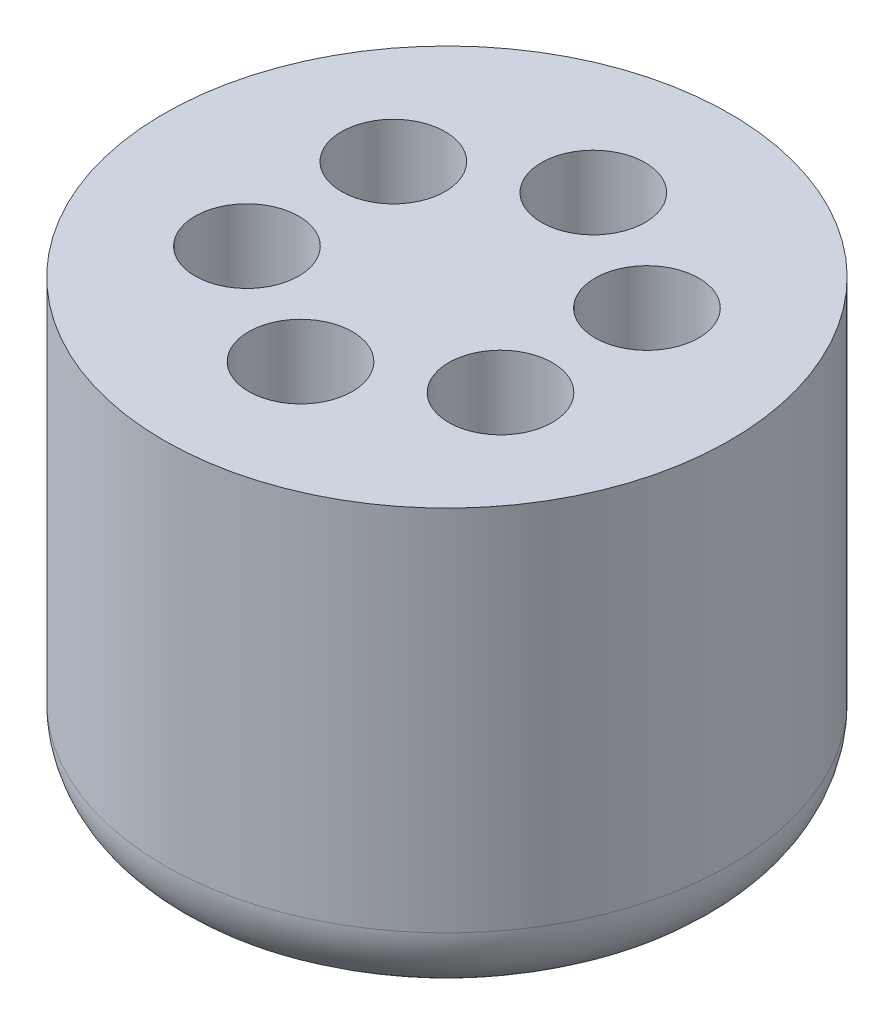
ISO-10303-21;
HEADER;
FILE_DESCRIPTION(('STEP AP214'),'2;1');
FILE_NAME('part.step','',(''),(''),'','','');
FILE_SCHEMA(('AUTOMOTIVE_DESIGN { 1 0 10303 214 1 1 1 1 }'));
ENDSEC;
DATA;
#1=APPLICATION_CONTEXT('core data for automotive mechanical design processes');
#2=APPLICATION_PROTOCOL_DEFINITION('international standard','automotive_design',2000,#1);
#3=PRODUCT_CONTEXT('',#1,'mechanical');
#4=PRODUCT('Part','Part','',(#3));
#5=PRODUCT_RELATED_PRODUCT_CATEGORY('part','',(#4));
#6=PRODUCT_DEFINITION_FORMATION('','',#4);
#7=PRODUCT_DEFINITION_CONTEXT('part definition',#1,'design');
#8=PRODUCT_DEFINITION('design','',#6,#7);
#9=PRODUCT_DEFINITION_SHAPE('','',#8);
#10=(LENGTH_UNIT() NAMED_UNIT(*) SI_UNIT(.MILLI.,.METRE.));
#11=(NAMED_UNIT(*) PLANE_ANGLE_UNIT() SI_UNIT($,.RADIAN.));
#12=(NAMED_UNIT(*) SI_UNIT($,.STERADIAN.) SOLID_ANGLE_UNIT());
#13=UNCERTAINTY_MEASURE_WITH_UNIT(LENGTH_MEASURE(1.E-05),#10,'distance_accuracy_value','');
#14=(GEOMETRIC_REPRESENTATION_CONTEXT(3) GLOBAL_UNCERTAINTY_ASSIGNED_CONTEXT((#13)) GLOBAL_UNIT_ASSIGNED_CONTEXT((#10,
#11,#12)) REPRESENTATION_CONTEXT('',''));
#15=CARTESIAN_POINT('',(0.,0.,0.));
#16=DIRECTION('',(0.,0.,1.));
#17=DIRECTION('',(1.,0.,0.));
#18=AXIS2_PLACEMENT_3D('',#15,#16,#17);
#19=CARTESIAN_POINT('',(0.,47.,0.));
#20=DIRECTION('',(0.,-1.,0.));
#21=DIRECTION('',(0.,0.,-1.));
#22=AXIS2_PLACEMENT_3D('',#19,#20,#21);
#23=CYLINDRICAL_SURFACE('',#22,30.);
#24=CARTESIAN_POINT('',(0.,8.,0.));
#25=DIRECTION('',(0.,1.,0.));
#26=DIRECTION('',(0.,0.,1.));
#27=AXIS2_PLACEMENT_3D('',#24,#25,#26);
#28=CIRCLE('',#27,30.);
#29=CARTESIAN_POINT('',(0.,8.,30.));
#30=VERTEX_POINT('',#29);
#31=EDGE_CURVE('E51',#30,#30,#28,.T.);
#32=ORIENTED_EDGE('',*,*,#31,.T.);
#33=EDGE_LOOP('',(#32));
#34=FACE_BOUND('',#33,.T.);
#35=CARTESIAN_POINT('',(0.,47.,0.));
#36=DIRECTION('',(0.,1.,0.));
#37=DIRECTION('',(0.,0.,1.));
#38=AXIS2_PLACEMENT_3D('',#35,#36,#37);
#39=CIRCLE('',#38,30.);
#40=CARTESIAN_POINT('',(0.,47.,30.));
#41=VERTEX_POINT('',#40);
#42=EDGE_CURVE('E56',#41,#41,#39,.T.);
#43=ORIENTED_EDGE('',*,*,#42,.F.);
#44=EDGE_LOOP('',(#43));
#45=FACE_BOUND('',#44,.T.);
#46=ADVANCED_FACE('F43',(#34,#45),#23,.T.);
#47=CARTESIAN_POINT('',(0.,47.,0.));
#48=DIRECTION('',(0.,1.,0.));
#49=DIRECTION('',(0.,0.,1.));
#50=AXIS2_PLACEMENT_3D('',#47,#48,#49);
#51=PLANE('',#50);
#52=CARTESIAN_POINT('',(-13.4407142667345,47.,-7.76000000000003));
#53=DIRECTION('',(0.,1.,0.));
#54=DIRECTION('',(0.,0.,1.));
#55=AXIS2_PLACEMENT_3D('',#52,#53,#54);
#56=CIRCLE('',#55,5.5);
#57=CARTESIAN_POINT('',(-13.4407142667345,47.,-2.26000000000003));
#58=VERTEX_POINT('',#57);
#59=EDGE_CURVE('E67',#58,#58,#56,.T.);
#60=ORIENTED_EDGE('',*,*,#59,.F.);
#61=EDGE_LOOP('',(#60));
#62=FACE_BOUND('',#61,.T.);
#63=CARTESIAN_POINT('',(-13.4407142667345,47.,7.76000000000006));
#64=DIRECTION('',(0.,1.,0.));
#65=DIRECTION('',(0.,0.,1.));
#66=AXIS2_PLACEMENT_3D('',#63,#64,#65);
#67=CIRCLE('',#66,5.5);
#68=CARTESIAN_POINT('',(-13.4407142667345,47.,13.2600000000001));
#69=VERTEX_POINT('',#68);
#70=EDGE_CURVE('E77',#69,#69,#67,.T.);
#71=ORIENTED_EDGE('',*,*,#70,.F.);
#72=EDGE_LOOP('',(#71));
#73=FACE_BOUND('',#72,.T.);
#74=CARTESIAN_POINT('',(0.,47.,15.52));
#75=DIRECTION('',(0.,1.,0.));
#76=DIRECTION('',(0.,0.,1.));
#77=AXIS2_PLACEMENT_3D('',#74,#75,#76);
#78=CIRCLE('',#77,5.5);
#79=CARTESIAN_POINT('',(0.,47.,21.02));
#80=VERTEX_POINT('',#79);
#81=EDGE_CURVE('E72',#80,#80,#78,.T.);
#82=ORIENTED_EDGE('',*,*,#81,.F.);
#83=EDGE_LOOP('',(#82));
#84=FACE_BOUND('',#83,.T.);
#85=CARTESIAN_POINT('',(13.4407142667345,47.,7.76000000000002));
#86=DIRECTION('',(0.,1.,0.));
#87=DIRECTION('',(0.,0.,1.));
#88=AXIS2_PLACEMENT_3D('',#85,#86,#87);
#89=CIRCLE('',#88,5.5);
#90=CARTESIAN_POINT('',(13.4407142667345,47.,13.26));
#91=VERTEX_POINT('',#90);
#92=EDGE_CURVE('E68',#91,#91,#89,.T.);
#93=ORIENTED_EDGE('',*,*,#92,.F.);
#94=EDGE_LOOP('',(#93));
#95=FACE_BOUND('',#94,.T.);
#96=CARTESIAN_POINT('',(13.4407142667345,47.,-7.76));
#97=DIRECTION('',(0.,1.,0.));
#98=DIRECTION('',(0.,0.,1.));
#99=AXIS2_PLACEMENT_3D('',#96,#97,#98);
#100=CIRCLE('',#99,5.5);
#101=CARTESIAN_POINT('',(13.4407142667345,47.,-2.26));
#102=VERTEX_POINT('',#101);
#103=EDGE_CURVE('E73',#102,#102,#100,.T.);
#104=ORIENTED_EDGE('',*,*,#103,.F.);
#105=EDGE_LOOP('',(#104));
#106=FACE_BOUND('',#105,.T.);
#107=CARTESIAN_POINT('',(0.,47.,-15.52));
#108=DIRECTION('',(0.,1.,0.));
#109=DIRECTION('',(0.,0.,1.));
#110=AXIS2_PLACEMENT_3D('',#107,#108,#109);
#111=CIRCLE('',#110,5.5);
#112=CARTESIAN_POINT('',(0.,47.,-10.02));
#113=VERTEX_POINT('',#112);
#114=EDGE_CURVE('E61',#113,#113,#111,.T.);
#115=ORIENTED_EDGE('',*,*,#114,.F.);
#116=EDGE_LOOP('',(#115));
#117=FACE_BOUND('',#116,.T.);
#118=ORIENTED_EDGE('',*,*,#42,.T.);
#119=EDGE_LOOP('',(#118));
#120=FACE_BOUND('',#119,.T.);
#121=ADVANCED_FACE('F133',(#62,#73,#84,#95,#106,#117,#120),#51,.T.);
#122=CARTESIAN_POINT('',(0.,0.,0.));
#123=DIRECTION('',(0.,1.,0.));
#124=DIRECTION('',(0.,0.,1.));
#125=AXIS2_PLACEMENT_3D('',#122,#123,#124);
#126=PLANE('',#125);
#127=CARTESIAN_POINT('',(0.,0.,0.));
#128=DIRECTION('',(0.,1.,0.));
#129=DIRECTION('',(0.,0.,1.));
#130=AXIS2_PLACEMENT_3D('',#127,#128,#129);
#131=CIRCLE('',#130,22.);
#132=CARTESIAN_POINT('',(0.,0.,22.));
#133=VERTEX_POINT('',#132);
#134=EDGE_CURVE('E10',#133,#133,#131,.F.);
#135=ORIENTED_EDGE('',*,*,#134,.T.);
#136=EDGE_LOOP('',(#135));
#137=FACE_BOUND('',#136,.T.);
#138=ADVANCED_FACE('F127',(#137),#126,.F.);
#139=CARTESIAN_POINT('',(0.,15.,-15.52));
#140=DIRECTION('',(0.,1.,0.));
#141=DIRECTION('',(0.,0.,1.));
#142=AXIS2_PLACEMENT_3D('',#139,#140,#141);
#143=CYLINDRICAL_SURFACE('',#142,5.5);
#144=ORIENTED_EDGE('',*,*,#114,.T.);
#145=EDGE_LOOP('',(#144));
#146=FACE_BOUND('',#145,.T.);
#147=CARTESIAN_POINT('',(0.,12.,-15.52));
#148=DIRECTION('',(0.,1.,0.));
#149=DIRECTION('',(0.,0.,1.));
#150=AXIS2_PLACEMENT_3D('',#147,#148,#149);
#151=CIRCLE('',#150,5.5);
#152=CARTESIAN_POINT('',(0.,12.,-10.02));
#153=VERTEX_POINT('',#152);
#154=EDGE_CURVE('E87',#153,#153,#151,.T.);
#155=ORIENTED_EDGE('',*,*,#154,.F.);
#156=EDGE_LOOP('',(#155));
#157=FACE_BOUND('',#156,.T.);
#158=ADVANCED_FACE('F117',(#146,#157),#143,.F.);
#159=CARTESIAN_POINT('',(13.4407142667345,15.,-7.76));
#160=DIRECTION('',(0.,1.,0.));
#161=DIRECTION('',(0.,0.,1.));
#162=AXIS2_PLACEMENT_3D('',#159,#160,#161);
#163=CYLINDRICAL_SURFACE('',#162,5.5);
#164=ORIENTED_EDGE('',*,*,#103,.T.);
#165=EDGE_LOOP('',(#164));
#166=FACE_BOUND('',#165,.T.);
#167=CARTESIAN_POINT('',(13.4407142667345,12.,-7.76));
#168=DIRECTION('',(0.,1.,0.));
#169=DIRECTION('',(0.,0.,1.));
#170=AXIS2_PLACEMENT_3D('',#167,#168,#169);
#171=CIRCLE('',#170,5.5);
#172=CARTESIAN_POINT('',(13.4407142667345,12.,-2.26));
#173=VERTEX_POINT('',#172);
#174=EDGE_CURVE('E97',#173,#173,#171,.T.);
#175=ORIENTED_EDGE('',*,*,#174,.F.);
#176=EDGE_LOOP('',(#175));
#177=FACE_BOUND('',#176,.T.);
#178=ADVANCED_FACE('F114',(#166,#177),#163,.F.);
#179=CARTESIAN_POINT('',(13.4407142667345,15.,7.76000000000002));
#180=DIRECTION('',(0.,1.,0.));
#181=DIRECTION('',(0.,0.,1.));
#182=AXIS2_PLACEMENT_3D('',#179,#180,#181);
#183=CYLINDRICAL_SURFACE('',#182,5.5);
#184=ORIENTED_EDGE('',*,*,#92,.T.);
#185=EDGE_LOOP('',(#184));
#186=FACE_BOUND('',#185,.T.);
#187=CARTESIAN_POINT('',(13.4407142667345,12.,7.76000000000002));
#188=DIRECTION('',(0.,1.,0.));
#189=DIRECTION('',(0.,0.,1.));
#190=AXIS2_PLACEMENT_3D('',#187,#188,#189);
#191=CIRCLE('',#190,5.5);
#192=CARTESIAN_POINT('',(13.4407142667345,12.,13.26));
#193=VERTEX_POINT('',#192);
#194=EDGE_CURVE('E92',#193,#193,#191,.T.);
#195=ORIENTED_EDGE('',*,*,#194,.F.);
#196=EDGE_LOOP('',(#195));
#197=FACE_BOUND('',#196,.T.);
#198=ADVANCED_FACE('F116',(#186,#197),#183,.F.);
#199=CARTESIAN_POINT('',(0.,15.,15.52));
#200=DIRECTION('',(0.,1.,0.));
#201=DIRECTION('',(0.,0.,1.));
#202=AXIS2_PLACEMENT_3D('',#199,#200,#201);
#203=CYLINDRICAL_SURFACE('',#202,5.5);
#204=ORIENTED_EDGE('',*,*,#81,.T.);
#205=EDGE_LOOP('',(#204));
#206=FACE_BOUND('',#205,.T.);
#207=CARTESIAN_POINT('',(0.,12.,15.52));
#208=DIRECTION('',(0.,1.,0.));
#209=DIRECTION('',(0.,0.,1.));
#210=AXIS2_PLACEMENT_3D('',#207,#208,#209);
#211=CIRCLE('',#210,5.5);
#212=CARTESIAN_POINT('',(0.,12.,21.02));
#213=VERTEX_POINT('',#212);
#214=EDGE_CURVE('E96',#213,#213,#211,.T.);
#215=ORIENTED_EDGE('',*,*,#214,.F.);
#216=EDGE_LOOP('',(#215));
#217=FACE_BOUND('',#216,.T.);
#218=ADVANCED_FACE('F124',(#206,#217),#203,.F.);
#219=CARTESIAN_POINT('',(-13.4407142667345,15.,7.76000000000006));
#220=DIRECTION('',(0.,1.,0.));
#221=DIRECTION('',(0.,0.,1.));
#222=AXIS2_PLACEMENT_3D('',#219,#220,#221);
#223=CYLINDRICAL_SURFACE('',#222,5.5);
#224=ORIENTED_EDGE('',*,*,#70,.T.);
#225=EDGE_LOOP('',(#224));
#226=FACE_BOUND('',#225,.T.);
#227=CARTESIAN_POINT('',(-13.4407142667345,12.,7.76000000000006));
#228=DIRECTION('',(0.,1.,0.));
#229=DIRECTION('',(0.,0.,1.));
#230=AXIS2_PLACEMENT_3D('',#227,#228,#229);
#231=CIRCLE('',#230,5.5);
#232=CARTESIAN_POINT('',(-13.4407142667345,12.,13.2600000000001));
#233=VERTEX_POINT('',#232);
#234=EDGE_CURVE('E101',#233,#233,#231,.T.);
#235=ORIENTED_EDGE('',*,*,#234,.F.);
#236=EDGE_LOOP('',(#235));
#237=FACE_BOUND('',#236,.T.);
#238=ADVANCED_FACE('F145',(#226,#237),#223,.F.);
#239=CARTESIAN_POINT('',(-13.4407142667345,15.,-7.76000000000003));
#240=DIRECTION('',(0.,1.,0.));
#241=DIRECTION('',(0.,0.,1.));
#242=AXIS2_PLACEMENT_3D('',#239,#240,#241);
#243=CYLINDRICAL_SURFACE('',#242,5.5);
#244=ORIENTED_EDGE('',*,*,#59,.T.);
#245=EDGE_LOOP('',(#244));
#246=FACE_BOUND('',#245,.T.);
#247=CARTESIAN_POINT('',(-13.4407142667345,12.,-7.76000000000003));
#248=DIRECTION('',(0.,1.,0.));
#249=DIRECTION('',(0.,0.,1.));
#250=AXIS2_PLACEMENT_3D('',#247,#248,#249);
#251=CIRCLE('',#250,5.5);
#252=CARTESIAN_POINT('',(-13.4407142667345,12.,-2.26000000000003));
#253=VERTEX_POINT('',#252);
#254=EDGE_CURVE('E91',#253,#253,#251,.T.);
#255=ORIENTED_EDGE('',*,*,#254,.F.);
#256=EDGE_LOOP('',(#255));
#257=FACE_BOUND('',#256,.T.);
#258=ADVANCED_FACE('F148',(#246,#257),#243,.F.);
#259=CARTESIAN_POINT('',(0.,8.,0.));
#260=DIRECTION('',(0.,1.,0.));
#261=DIRECTION('',(0.,0.,1.));
#262=AXIS2_PLACEMENT_3D('',#259,#260,#261);
#263=TOROIDAL_SURFACE('',#262,22.,8.);
#264=ORIENTED_EDGE('',*,*,#134,.F.);
#265=EDGE_LOOP('',(#264));
#266=FACE_BOUND('',#265,.T.);
#267=ORIENTED_EDGE('',*,*,#31,.F.);
#268=EDGE_LOOP('',(#267));
#269=FACE_BOUND('',#268,.T.);
#270=ADVANCED_FACE('F45',(#266,#269),#263,.T.);
#271=CARTESIAN_POINT('',(-13.4407142667345,12.,-7.76000000000003));
#272=DIRECTION('',(0.,1.,0.));
#273=DIRECTION('',(0.,0.,1.));
#274=AXIS2_PLACEMENT_3D('',#271,#272,#273);
#275=PLANE('',#274);
#276=ORIENTED_EDGE('',*,*,#254,.T.);
#277=EDGE_LOOP('',(#276));
#278=FACE_BOUND('',#277,.T.);
#279=ADVANCED_FACE('F156',(#278),#275,.T.);
#280=CARTESIAN_POINT('',(-13.4407142667345,12.,7.76000000000006));
#281=DIRECTION('',(0.,1.,0.));
#282=DIRECTION('',(0.,0.,1.));
#283=AXIS2_PLACEMENT_3D('',#280,#281,#282);
#284=PLANE('',#283);
#285=ORIENTED_EDGE('',*,*,#234,.T.);
#286=EDGE_LOOP('',(#285));
#287=FACE_BOUND('',#286,.T.);
#288=ADVANCED_FACE('F162',(#287),#284,.T.);
#289=CARTESIAN_POINT('',(0.,12.,15.52));
#290=DIRECTION('',(0.,1.,0.));
#291=DIRECTION('',(0.,0.,1.));
#292=AXIS2_PLACEMENT_3D('',#289,#290,#291);
#293=PLANE('',#292);
#294=ORIENTED_EDGE('',*,*,#214,.T.);
#295=EDGE_LOOP('',(#294));
#296=FACE_BOUND('',#295,.T.);
#297=ADVANCED_FACE('F167',(#296),#293,.T.);
#298=CARTESIAN_POINT('',(13.4407142667345,12.,7.76000000000002));
#299=DIRECTION('',(0.,1.,0.));
#300=DIRECTION('',(0.,0.,1.));
#301=AXIS2_PLACEMENT_3D('',#298,#299,#300);
#302=PLANE('',#301);
#303=ORIENTED_EDGE('',*,*,#194,.T.);
#304=EDGE_LOOP('',(#303));
#305=FACE_BOUND('',#304,.T.);
#306=ADVANCED_FACE('F174',(#305),#302,.T.);
#307=CARTESIAN_POINT('',(13.4407142667345,12.,-7.76));
#308=DIRECTION('',(0.,1.,0.));
#309=DIRECTION('',(0.,0.,1.));
#310=AXIS2_PLACEMENT_3D('',#307,#308,#309);
#311=PLANE('',#310);
#312=ORIENTED_EDGE('',*,*,#174,.T.);
#313=EDGE_LOOP('',(#312));
#314=FACE_BOUND('',#313,.T.);
#315=ADVANCED_FACE('F112',(#314),#311,.T.);
#316=CARTESIAN_POINT('',(0.,12.,-15.52));
#317=DIRECTION('',(0.,1.,0.));
#318=DIRECTION('',(0.,0.,1.));
#319=AXIS2_PLACEMENT_3D('',#316,#317,#318);
#320=PLANE('',#319);
#321=ORIENTED_EDGE('',*,*,#154,.T.);
#322=EDGE_LOOP('',(#321));
#323=FACE_BOUND('',#322,.T.);
#324=ADVANCED_FACE('F178',(#323),#320,.T.);
#325=CLOSED_SHELL('',(#46,#121,#138,#158,#178,#198,#218,#238,#258,#270,#279,#288,#297,#306,#315,#324));
#326=MANIFOLD_SOLID_BREP('B2',#325);
#327=ADVANCED_BREP_SHAPE_REPRESENTATION('',(#18,#326),#14);
#328=SHAPE_DEFINITION_REPRESENTATION(#9,#327);
ENDSEC;
END-ISO-10303-21;
